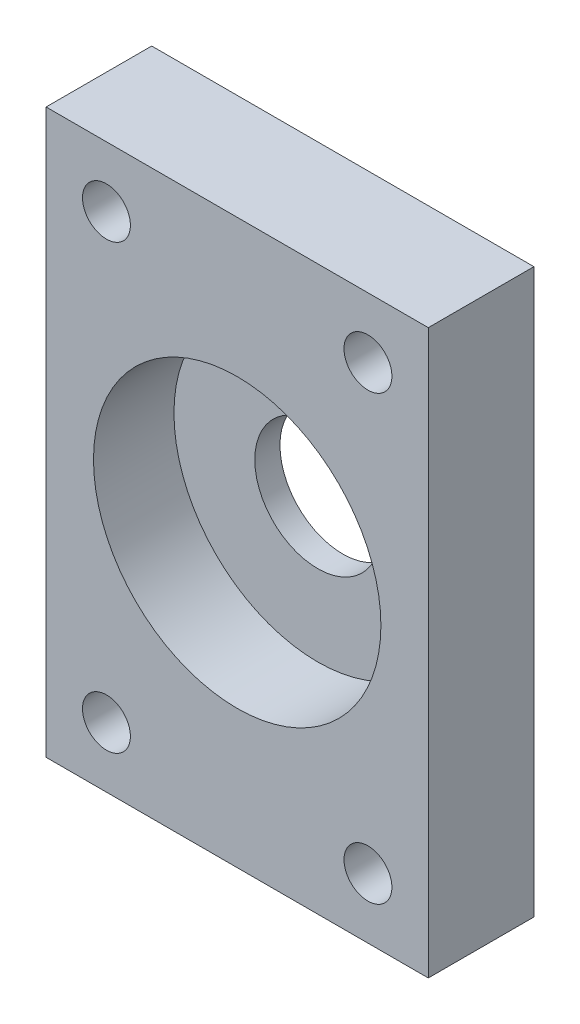
ISO-10303-21;
HEADER;
FILE_DESCRIPTION(('STEP AP214'),'2;1');
FILE_NAME('part.step','',(''),(''),'','','');
FILE_SCHEMA(('AUTOMOTIVE_DESIGN { 1 0 10303 214 1 1 1 1 }'));
ENDSEC;
DATA;
#1=APPLICATION_CONTEXT('core data for automotive mechanical design processes');
#2=APPLICATION_PROTOCOL_DEFINITION('international standard','automotive_design',2000,#1);
#3=PRODUCT_CONTEXT('',#1,'mechanical');
#4=PRODUCT('Part','Part','',(#3));
#5=PRODUCT_RELATED_PRODUCT_CATEGORY('part','',(#4));
#6=PRODUCT_DEFINITION_FORMATION('','',#4);
#7=PRODUCT_DEFINITION_CONTEXT('part definition',#1,'design');
#8=PRODUCT_DEFINITION('design','',#6,#7);
#9=PRODUCT_DEFINITION_SHAPE('','',#8);
#10=(LENGTH_UNIT() NAMED_UNIT(*) SI_UNIT(.MILLI.,.METRE.));
#11=(NAMED_UNIT(*) PLANE_ANGLE_UNIT() SI_UNIT($,.RADIAN.));
#12=(NAMED_UNIT(*) SI_UNIT($,.STERADIAN.) SOLID_ANGLE_UNIT());
#13=UNCERTAINTY_MEASURE_WITH_UNIT(LENGTH_MEASURE(1.E-05),#10,'distance_accuracy_value','');
#14=(GEOMETRIC_REPRESENTATION_CONTEXT(3) GLOBAL_UNCERTAINTY_ASSIGNED_CONTEXT((#13)) GLOBAL_UNIT_ASSIGNED_CONTEXT((#10,
#11,#12)) REPRESENTATION_CONTEXT('',''));
#15=CARTESIAN_POINT('',(0.,0.,0.));
#16=DIRECTION('',(0.,0.,1.));
#17=DIRECTION('',(1.,0.,0.));
#18=AXIS2_PLACEMENT_3D('',#15,#16,#17);
#19=CARTESIAN_POINT('',(0.,0.,8.));
#20=DIRECTION('',(0.,0.,1.));
#21=DIRECTION('',(1.,0.,0.));
#22=AXIS2_PLACEMENT_3D('',#19,#20,#21);
#23=PLANE('',#22);
#24=CARTESIAN_POINT('',(13.,-22.,8.));
#25=DIRECTION('',(0.,0.,-1.));
#26=DIRECTION('',(1.,0.,0.));
#27=AXIS2_PLACEMENT_3D('',#24,#25,#26);
#28=CIRCLE('',#27,2.38125);
#29=CARTESIAN_POINT('',(15.38125,-22.,8.));
#30=VERTEX_POINT('',#29);
#31=EDGE_CURVE('E129',#30,#30,#28,.T.);
#32=ORIENTED_EDGE('',*,*,#31,.T.);
#33=EDGE_LOOP('',(#32));
#34=FACE_BOUND('',#33,.T.);
#35=CARTESIAN_POINT('',(-13.,-22.,8.));
#36=DIRECTION('',(0.,0.,-1.));
#37=DIRECTION('',(-1.,0.,0.));
#38=AXIS2_PLACEMENT_3D('',#35,#36,#37);
#39=CIRCLE('',#38,2.38125);
#40=CARTESIAN_POINT('',(-15.38125,-22.,8.));
#41=VERTEX_POINT('',#40);
#42=EDGE_CURVE('E133',#41,#41,#39,.T.);
#43=ORIENTED_EDGE('',*,*,#42,.T.);
#44=EDGE_LOOP('',(#43));
#45=FACE_BOUND('',#44,.T.);
#46=CARTESIAN_POINT('',(-13.,22.,8.));
#47=DIRECTION('',(0.,0.,-1.));
#48=DIRECTION('',(1.,0.,0.));
#49=AXIS2_PLACEMENT_3D('',#46,#47,#48);
#50=CIRCLE('',#49,2.38125);
#51=CARTESIAN_POINT('',(-10.61875,22.,8.));
#52=VERTEX_POINT('',#51);
#53=EDGE_CURVE('E137',#52,#52,#50,.T.);
#54=ORIENTED_EDGE('',*,*,#53,.T.);
#55=EDGE_LOOP('',(#54));
#56=FACE_BOUND('',#55,.T.);
#57=CARTESIAN_POINT('',(13.,22.,8.));
#58=DIRECTION('',(0.,0.,-1.));
#59=DIRECTION('',(-1.,0.,0.));
#60=AXIS2_PLACEMENT_3D('',#57,#58,#59);
#61=CIRCLE('',#60,2.38125);
#62=CARTESIAN_POINT('',(10.61875,22.,8.));
#63=VERTEX_POINT('',#62);
#64=EDGE_CURVE('E141',#63,#63,#61,.T.);
#65=ORIENTED_EDGE('',*,*,#64,.T.);
#66=EDGE_LOOP('',(#65));
#67=FACE_BOUND('',#66,.T.);
#68=CARTESIAN_POINT('',(0.,0.,8.));
#69=DIRECTION('',(0.,0.,1.));
#70=DIRECTION('',(1.,0.,0.));
#71=AXIS2_PLACEMENT_3D('',#68,#69,#70);
#72=CIRCLE('',#71,14.2875);
#73=CARTESIAN_POINT('',(14.2875,0.,8.));
#74=VERTEX_POINT('',#73);
#75=EDGE_CURVE('E11',#74,#74,#72,.T.);
#76=ORIENTED_EDGE('',*,*,#75,.F.);
#77=EDGE_LOOP('',(#76));
#78=FACE_BOUND('',#77,.T.);
#79=DIRECTION('',(0.,1.,0.));
#80=VECTOR('',#79,1.);
#81=CARTESIAN_POINT('',(-19.,-28.,8.));
#82=LINE('',#81,#80);
#83=CARTESIAN_POINT('',(-19.,-28.,8.));
#84=VERTEX_POINT('',#83);
#85=CARTESIAN_POINT('',(-19.,28.,8.));
#86=VERTEX_POINT('',#85);
#87=EDGE_CURVE('E101',#84,#86,#82,.T.);
#88=ORIENTED_EDGE('',*,*,#87,.F.);
#89=DIRECTION('',(-1.,0.,0.));
#90=VECTOR('',#89,1.);
#91=CARTESIAN_POINT('',(19.,-28.,8.));
#92=LINE('',#91,#90);
#93=CARTESIAN_POINT('',(19.,-28.,8.));
#94=VERTEX_POINT('',#93);
#95=EDGE_CURVE('E76',#94,#84,#92,.T.);
#96=ORIENTED_EDGE('',*,*,#95,.F.);
#97=DIRECTION('',(0.,-1.,0.));
#98=VECTOR('',#97,1.);
#99=CARTESIAN_POINT('',(19.,-28.,8.));
#100=LINE('',#99,#98);
#101=CARTESIAN_POINT('',(19.,28.,8.));
#102=VERTEX_POINT('',#101);
#103=EDGE_CURVE('E106',#102,#94,#100,.T.);
#104=ORIENTED_EDGE('',*,*,#103,.F.);
#105=DIRECTION('',(1.,0.,0.));
#106=VECTOR('',#105,1.);
#107=CARTESIAN_POINT('',(19.,28.,8.));
#108=LINE('',#107,#106);
#109=EDGE_CURVE('E103',#86,#102,#108,.T.);
#110=ORIENTED_EDGE('',*,*,#109,.F.);
#111=EDGE_LOOP('',(#88,#96,#104,#110));
#112=FACE_BOUND('',#111,.T.);
#113=ADVANCED_FACE('F33',(#34,#45,#56,#67,#78,#112),#23,.T.);
#114=CARTESIAN_POINT('',(0.,0.,8.));
#115=DIRECTION('',(0.,0.,-1.));
#116=DIRECTION('',(-1.,0.,0.));
#117=AXIS2_PLACEMENT_3D('',#114,#115,#116);
#118=CYLINDRICAL_SURFACE('',#117,14.2875);
#119=ORIENTED_EDGE('',*,*,#75,.T.);
#120=EDGE_LOOP('',(#119));
#121=FACE_BOUND('',#120,.T.);
#122=CARTESIAN_POINT('',(0.,0.,0.));
#123=DIRECTION('',(0.,0.,1.));
#124=DIRECTION('',(1.,0.,0.));
#125=AXIS2_PLACEMENT_3D('',#122,#123,#124);
#126=CIRCLE('',#125,14.2875);
#127=CARTESIAN_POINT('',(14.2875,0.,0.));
#128=VERTEX_POINT('',#127);
#129=EDGE_CURVE('E36',#128,#128,#126,.T.);
#130=ORIENTED_EDGE('',*,*,#129,.F.);
#131=EDGE_LOOP('',(#130));
#132=FACE_BOUND('',#131,.T.);
#133=ADVANCED_FACE('F120',(#121,#132),#118,.F.);
#134=CARTESIAN_POINT('',(-19.,-28.,8.));
#135=DIRECTION('',(-1.,0.,0.));
#136=DIRECTION('',(0.,0.,1.));
#137=AXIS2_PLACEMENT_3D('',#134,#135,#136);
#138=PLANE('',#137);
#139=DIRECTION('',(0.,0.,-1.));
#140=VECTOR('',#139,1.);
#141=CARTESIAN_POINT('',(-19.,28.,8.));
#142=LINE('',#141,#140);
#143=CARTESIAN_POINT('',(-19.,28.,-2.5));
#144=VERTEX_POINT('',#143);
#145=EDGE_CURVE('E81',#86,#144,#142,.T.);
#146=ORIENTED_EDGE('',*,*,#145,.T.);
#147=DIRECTION('',(0.,1.,0.));
#148=VECTOR('',#147,1.);
#149=CARTESIAN_POINT('',(-19.,-28.,-2.5));
#150=LINE('',#149,#148);
#151=CARTESIAN_POINT('',(-19.,-28.,-2.5));
#152=VERTEX_POINT('',#151);
#153=EDGE_CURVE('E79',#152,#144,#150,.T.);
#154=ORIENTED_EDGE('',*,*,#153,.F.);
#155=DIRECTION('',(0.,0.,-1.));
#156=VECTOR('',#155,1.);
#157=CARTESIAN_POINT('',(-19.,-28.,8.));
#158=LINE('',#157,#156);
#159=EDGE_CURVE('E47',#84,#152,#158,.T.);
#160=ORIENTED_EDGE('',*,*,#159,.F.);
#161=ORIENTED_EDGE('',*,*,#87,.T.);
#162=EDGE_LOOP('',(#146,#154,#160,#161));
#163=FACE_BOUND('',#162,.T.);
#164=ADVANCED_FACE('F80',(#163),#138,.T.);
#165=CARTESIAN_POINT('',(19.,-28.,8.));
#166=DIRECTION('',(0.,-1.,0.));
#167=DIRECTION('',(0.,0.,-1.));
#168=AXIS2_PLACEMENT_3D('',#165,#166,#167);
#169=PLANE('',#168);
#170=ORIENTED_EDGE('',*,*,#159,.T.);
#171=DIRECTION('',(-1.,0.,0.));
#172=VECTOR('',#171,1.);
#173=CARTESIAN_POINT('',(19.,-28.,-2.5));
#174=LINE('',#173,#172);
#175=CARTESIAN_POINT('',(19.,-28.,-2.5));
#176=VERTEX_POINT('',#175);
#177=EDGE_CURVE('E74',#176,#152,#174,.T.);
#178=ORIENTED_EDGE('',*,*,#177,.F.);
#179=DIRECTION('',(0.,0.,-1.));
#180=VECTOR('',#179,1.);
#181=CARTESIAN_POINT('',(19.,-28.,8.));
#182=LINE('',#181,#180);
#183=EDGE_CURVE('E55',#94,#176,#182,.T.);
#184=ORIENTED_EDGE('',*,*,#183,.F.);
#185=ORIENTED_EDGE('',*,*,#95,.T.);
#186=EDGE_LOOP('',(#170,#178,#184,#185));
#187=FACE_BOUND('',#186,.T.);
#188=ADVANCED_FACE('F72',(#187),#169,.T.);
#189=CARTESIAN_POINT('',(19.,-28.,8.));
#190=DIRECTION('',(1.,0.,0.));
#191=DIRECTION('',(0.,0.,-1.));
#192=AXIS2_PLACEMENT_3D('',#189,#190,#191);
#193=PLANE('',#192);
#194=ORIENTED_EDGE('',*,*,#183,.T.);
#195=DIRECTION('',(0.,-1.,0.));
#196=VECTOR('',#195,1.);
#197=CARTESIAN_POINT('',(19.,28.,-2.5));
#198=LINE('',#197,#196);
#199=CARTESIAN_POINT('',(19.,28.,-2.5));
#200=VERTEX_POINT('',#199);
#201=EDGE_CURVE('E91',#200,#176,#198,.T.);
#202=ORIENTED_EDGE('',*,*,#201,.F.);
#203=DIRECTION('',(0.,0.,-1.));
#204=VECTOR('',#203,1.);
#205=CARTESIAN_POINT('',(19.,28.,8.));
#206=LINE('',#205,#204);
#207=EDGE_CURVE('E110',#102,#200,#206,.T.);
#208=ORIENTED_EDGE('',*,*,#207,.F.);
#209=ORIENTED_EDGE('',*,*,#103,.T.);
#210=EDGE_LOOP('',(#194,#202,#208,#209));
#211=FACE_BOUND('',#210,.T.);
#212=ADVANCED_FACE('F117',(#211),#193,.T.);
#213=CARTESIAN_POINT('',(19.,28.,8.));
#214=DIRECTION('',(0.,1.,0.));
#215=DIRECTION('',(0.,0.,1.));
#216=AXIS2_PLACEMENT_3D('',#213,#214,#215);
#217=PLANE('',#216);
#218=ORIENTED_EDGE('',*,*,#207,.T.);
#219=DIRECTION('',(1.,0.,0.));
#220=VECTOR('',#219,1.);
#221=CARTESIAN_POINT('',(-19.,28.,-2.5));
#222=LINE('',#221,#220);
#223=EDGE_CURVE('E85',#144,#200,#222,.T.);
#224=ORIENTED_EDGE('',*,*,#223,.F.);
#225=ORIENTED_EDGE('',*,*,#145,.F.);
#226=ORIENTED_EDGE('',*,*,#109,.T.);
#227=EDGE_LOOP('',(#218,#224,#225,#226));
#228=FACE_BOUND('',#227,.T.);
#229=ADVANCED_FACE('F113',(#228),#217,.T.);
#230=CARTESIAN_POINT('',(0.,0.,0.));
#231=DIRECTION('',(0.,0.,-1.));
#232=DIRECTION('',(-1.,0.,0.));
#233=AXIS2_PLACEMENT_3D('',#230,#231,#232);
#234=PLANE('',#233);
#235=CARTESIAN_POINT('',(0.,0.,0.));
#236=DIRECTION('',(0.,0.,-1.));
#237=DIRECTION('',(-1.,0.,0.));
#238=AXIS2_PLACEMENT_3D('',#235,#236,#237);
#239=CIRCLE('',#238,6.25);
#240=CARTESIAN_POINT('',(-6.25,0.,0.));
#241=VERTEX_POINT('',#240);
#242=EDGE_CURVE('E95',#241,#241,#239,.T.);
#243=ORIENTED_EDGE('',*,*,#242,.T.);
#244=EDGE_LOOP('',(#243));
#245=FACE_BOUND('',#244,.T.);
#246=ORIENTED_EDGE('',*,*,#129,.T.);
#247=EDGE_LOOP('',(#246));
#248=FACE_BOUND('',#247,.T.);
#249=ADVANCED_FACE('F147',(#245,#248),#234,.F.);
#250=CARTESIAN_POINT('',(0.,0.,-2.5));
#251=DIRECTION('',(0.,0.,-1.));
#252=DIRECTION('',(-1.,0.,0.));
#253=AXIS2_PLACEMENT_3D('',#250,#251,#252);
#254=PLANE('',#253);
#255=CARTESIAN_POINT('',(13.,-22.,-2.5));
#256=DIRECTION('',(0.,0.,-1.));
#257=DIRECTION('',(1.,0.,0.));
#258=AXIS2_PLACEMENT_3D('',#255,#256,#257);
#259=CIRCLE('',#258,2.38125);
#260=CARTESIAN_POINT('',(15.38125,-22.,-2.5));
#261=VERTEX_POINT('',#260);
#262=EDGE_CURVE('E256',#261,#261,#259,.T.);
#263=ORIENTED_EDGE('',*,*,#262,.F.);
#264=EDGE_LOOP('',(#263));
#265=FACE_BOUND('',#264,.T.);
#266=CARTESIAN_POINT('',(-13.,-22.,-2.5));
#267=DIRECTION('',(0.,0.,-1.));
#268=DIRECTION('',(-1.,0.,0.));
#269=AXIS2_PLACEMENT_3D('',#266,#267,#268);
#270=CIRCLE('',#269,2.38125);
#271=CARTESIAN_POINT('',(-15.38125,-22.,-2.5));
#272=VERTEX_POINT('',#271);
#273=EDGE_CURVE('E258',#272,#272,#270,.T.);
#274=ORIENTED_EDGE('',*,*,#273,.F.);
#275=EDGE_LOOP('',(#274));
#276=FACE_BOUND('',#275,.T.);
#277=CARTESIAN_POINT('',(-13.,22.,-2.5));
#278=DIRECTION('',(0.,0.,-1.));
#279=DIRECTION('',(1.,0.,0.));
#280=AXIS2_PLACEMENT_3D('',#277,#278,#279);
#281=CIRCLE('',#280,2.38125);
#282=CARTESIAN_POINT('',(-10.61875,22.,-2.5));
#283=VERTEX_POINT('',#282);
#284=EDGE_CURVE('E267',#283,#283,#281,.T.);
#285=ORIENTED_EDGE('',*,*,#284,.F.);
#286=EDGE_LOOP('',(#285));
#287=FACE_BOUND('',#286,.T.);
#288=CARTESIAN_POINT('',(13.,22.,-2.5));
#289=DIRECTION('',(0.,0.,-1.));
#290=DIRECTION('',(-1.,0.,0.));
#291=AXIS2_PLACEMENT_3D('',#288,#289,#290);
#292=CIRCLE('',#291,2.38125);
#293=CARTESIAN_POINT('',(10.61875,22.,-2.5));
#294=VERTEX_POINT('',#293);
#295=EDGE_CURVE('E263',#294,#294,#292,.T.);
#296=ORIENTED_EDGE('',*,*,#295,.F.);
#297=EDGE_LOOP('',(#296));
#298=FACE_BOUND('',#297,.T.);
#299=ORIENTED_EDGE('',*,*,#177,.T.);
#300=ORIENTED_EDGE('',*,*,#153,.T.);
#301=ORIENTED_EDGE('',*,*,#223,.T.);
#302=ORIENTED_EDGE('',*,*,#201,.T.);
#303=EDGE_LOOP('',(#299,#300,#301,#302));
#304=FACE_BOUND('',#303,.T.);
#305=CARTESIAN_POINT('',(0.,0.,-2.5));
#306=DIRECTION('',(0.,0.,-1.));
#307=DIRECTION('',(-1.,0.,0.));
#308=AXIS2_PLACEMENT_3D('',#305,#306,#307);
#309=CIRCLE('',#308,6.25);
#310=CARTESIAN_POINT('',(-6.25,0.,-2.5));
#311=VERTEX_POINT('',#310);
#312=EDGE_CURVE('E92',#311,#311,#309,.T.);
#313=ORIENTED_EDGE('',*,*,#312,.F.);
#314=EDGE_LOOP('',(#313));
#315=FACE_BOUND('',#314,.T.);
#316=ADVANCED_FACE('F88',(#265,#276,#287,#298,#304,#315),#254,.T.);
#317=CARTESIAN_POINT('',(0.,0.,-2.5));
#318=DIRECTION('',(0.,0.,1.));
#319=DIRECTION('',(1.,0.,0.));
#320=AXIS2_PLACEMENT_3D('',#317,#318,#319);
#321=CYLINDRICAL_SURFACE('',#320,6.25);
#322=ORIENTED_EDGE('',*,*,#312,.T.);
#323=EDGE_LOOP('',(#322));
#324=FACE_BOUND('',#323,.T.);
#325=ORIENTED_EDGE('',*,*,#242,.F.);
#326=EDGE_LOOP('',(#325));
#327=FACE_BOUND('',#326,.T.);
#328=ADVANCED_FACE('F155',(#324,#327),#321,.F.);
#329=CARTESIAN_POINT('',(13.,22.,8.));
#330=DIRECTION('',(0.,0.,-1.));
#331=DIRECTION('',(-1.,0.,0.));
#332=AXIS2_PLACEMENT_3D('',#329,#330,#331);
#333=CYLINDRICAL_SURFACE('',#332,2.38125);
#334=ORIENTED_EDGE('',*,*,#64,.F.);
#335=EDGE_LOOP('',(#334));
#336=FACE_BOUND('',#335,.T.);
#337=ORIENTED_EDGE('',*,*,#295,.T.);
#338=EDGE_LOOP('',(#337));
#339=FACE_BOUND('',#338,.T.);
#340=ADVANCED_FACE('F197',(#336,#339),#333,.F.);
#341=CARTESIAN_POINT('',(-13.,22.,8.));
#342=DIRECTION('',(0.,0.,-1.));
#343=DIRECTION('',(-1.,0.,0.));
#344=AXIS2_PLACEMENT_3D('',#341,#342,#343);
#345=CYLINDRICAL_SURFACE('',#344,2.38125);
#346=ORIENTED_EDGE('',*,*,#53,.F.);
#347=EDGE_LOOP('',(#346));
#348=FACE_BOUND('',#347,.T.);
#349=ORIENTED_EDGE('',*,*,#284,.T.);
#350=EDGE_LOOP('',(#349));
#351=FACE_BOUND('',#350,.T.);
#352=ADVANCED_FACE('F219',(#348,#351),#345,.F.);
#353=CARTESIAN_POINT('',(-13.,-22.,8.));
#354=DIRECTION('',(0.,0.,-1.));
#355=DIRECTION('',(-1.,0.,0.));
#356=AXIS2_PLACEMENT_3D('',#353,#354,#355);
#357=CYLINDRICAL_SURFACE('',#356,2.38125);
#358=ORIENTED_EDGE('',*,*,#42,.F.);
#359=EDGE_LOOP('',(#358));
#360=FACE_BOUND('',#359,.T.);
#361=ORIENTED_EDGE('',*,*,#273,.T.);
#362=EDGE_LOOP('',(#361));
#363=FACE_BOUND('',#362,.T.);
#364=ADVANCED_FACE('F229',(#360,#363),#357,.F.);
#365=CARTESIAN_POINT('',(13.,-22.,8.));
#366=DIRECTION('',(0.,0.,-1.));
#367=DIRECTION('',(-1.,0.,0.));
#368=AXIS2_PLACEMENT_3D('',#365,#366,#367);
#369=CYLINDRICAL_SURFACE('',#368,2.38125);
#370=ORIENTED_EDGE('',*,*,#31,.F.);
#371=EDGE_LOOP('',(#370));
#372=FACE_BOUND('',#371,.T.);
#373=ORIENTED_EDGE('',*,*,#262,.T.);
#374=EDGE_LOOP('',(#373));
#375=FACE_BOUND('',#374,.T.);
#376=ADVANCED_FACE('F239',(#372,#375),#369,.F.);
#377=CLOSED_SHELL('',(#113,#133,#164,#188,#212,#229,#249,#316,#328,#340,#352,#364,#376));
#378=MANIFOLD_SOLID_BREP('B2',#377);
#379=ADVANCED_BREP_SHAPE_REPRESENTATION('',(#18,#378),#14);
#380=SHAPE_DEFINITION_REPRESENTATION(#9,#379);
ENDSEC;
END-ISO-10303-21;
